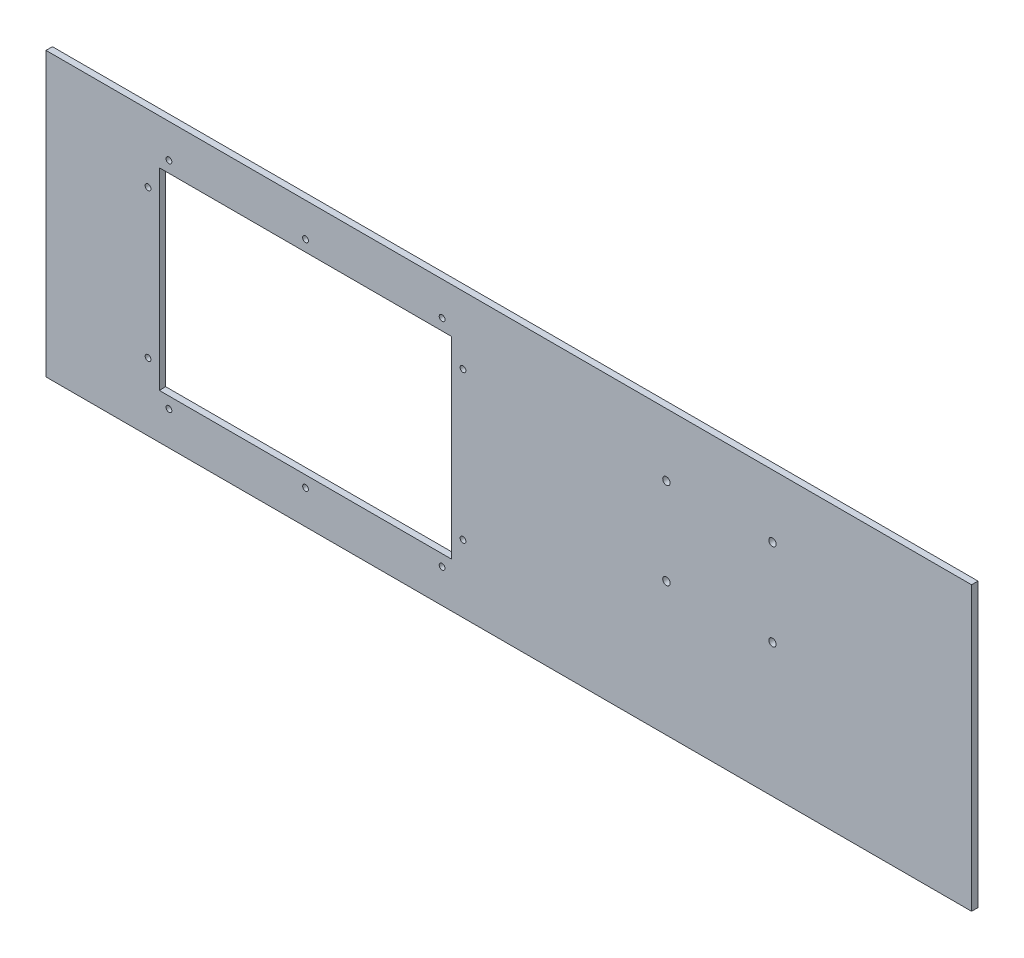
ISO-10303-21;
HEADER;
FILE_DESCRIPTION(('STEP AP214'),'2;1');
FILE_NAME('part.step','',(''),(''),'','','');
FILE_SCHEMA(('AUTOMOTIVE_DESIGN { 1 0 10303 214 1 1 1 1 }'));
ENDSEC;
DATA;
#1=APPLICATION_CONTEXT('core data for automotive mechanical design processes');
#2=APPLICATION_PROTOCOL_DEFINITION('international standard','automotive_design',2000,#1);
#3=PRODUCT_CONTEXT('',#1,'mechanical');
#4=PRODUCT('Part','Part','',(#3));
#5=PRODUCT_RELATED_PRODUCT_CATEGORY('part','',(#4));
#6=PRODUCT_DEFINITION_FORMATION('','',#4);
#7=PRODUCT_DEFINITION_CONTEXT('part definition',#1,'design');
#8=PRODUCT_DEFINITION('design','',#6,#7);
#9=PRODUCT_DEFINITION_SHAPE('','',#8);
#10=(LENGTH_UNIT() NAMED_UNIT(*) SI_UNIT(.MILLI.,.METRE.));
#11=(NAMED_UNIT(*) PLANE_ANGLE_UNIT() SI_UNIT($,.RADIAN.));
#12=(NAMED_UNIT(*) SI_UNIT($,.STERADIAN.) SOLID_ANGLE_UNIT());
#13=UNCERTAINTY_MEASURE_WITH_UNIT(LENGTH_MEASURE(1.E-05),#10,'distance_accuracy_value','');
#14=(GEOMETRIC_REPRESENTATION_CONTEXT(3) GLOBAL_UNCERTAINTY_ASSIGNED_CONTEXT((#13)) GLOBAL_UNIT_ASSIGNED_CONTEXT((#10,
#11,#12)) REPRESENTATION_CONTEXT('',''));
#15=CARTESIAN_POINT('',(0.,0.,0.));
#16=DIRECTION('',(0.,0.,1.));
#17=DIRECTION('',(1.,0.,0.));
#18=AXIS2_PLACEMENT_3D('',#15,#16,#17);
#19=CARTESIAN_POINT('',(0.,0.,-10.));
#20=DIRECTION('',(0.,0.,1.));
#21=DIRECTION('',(1.,0.,0.));
#22=AXIS2_PLACEMENT_3D('',#19,#20,#21);
#23=PLANE('',#22);
#24=CARTESIAN_POINT('',(410.249999999993,-12.5000000000117,-10.));
#25=DIRECTION('',(0.,0.,1.));
#26=DIRECTION('',(1.,0.,0.));
#27=AXIS2_PLACEMENT_3D('',#24,#25,#26);
#28=CIRCLE('',#27,5.74999999999991);
#29=CARTESIAN_POINT('',(415.999999999993,-12.5000000000117,-10.));
#30=VERTEX_POINT('',#29);
#31=EDGE_CURVE('E290',#30,#30,#28,.T.);
#32=ORIENTED_EDGE('',*,*,#31,.T.);
#33=EDGE_LOOP('',(#32));
#34=FACE_BOUND('',#33,.T.);
#35=CARTESIAN_POINT('',(410.249999999994,122.499999999988,-10.));
#36=DIRECTION('',(0.,0.,1.));
#37=DIRECTION('',(1.,0.,0.));
#38=AXIS2_PLACEMENT_3D('',#35,#36,#37);
#39=CIRCLE('',#38,5.74999999999992);
#40=CARTESIAN_POINT('',(415.999999999993,122.499999999988,-10.));
#41=VERTEX_POINT('',#40);
#42=EDGE_CURVE('E280',#41,#41,#39,.T.);
#43=ORIENTED_EDGE('',*,*,#42,.T.);
#44=EDGE_LOOP('',(#43));
#45=FACE_BOUND('',#44,.T.);
#46=CARTESIAN_POINT('',(245.249999999994,122.499999999989,-10.));
#47=DIRECTION('',(0.,0.,1.));
#48=DIRECTION('',(1.,0.,0.));
#49=AXIS2_PLACEMENT_3D('',#46,#47,#48);
#50=CIRCLE('',#49,5.75000000000003);
#51=CARTESIAN_POINT('',(250.999999999994,122.499999999989,-10.));
#52=VERTEX_POINT('',#51);
#53=EDGE_CURVE('E275',#52,#52,#50,.T.);
#54=ORIENTED_EDGE('',*,*,#53,.T.);
#55=EDGE_LOOP('',(#54));
#56=FACE_BOUND('',#55,.T.);
#57=CARTESIAN_POINT('',(245.249999999993,-12.5000000000111,-10.));
#58=DIRECTION('',(0.,0.,1.));
#59=DIRECTION('',(1.,0.,0.));
#60=AXIS2_PLACEMENT_3D('',#57,#58,#59);
#61=CIRCLE('',#60,5.75000000000003);
#62=CARTESIAN_POINT('',(250.999999999993,-12.5000000000111,-10.));
#63=VERTEX_POINT('',#62);
#64=EDGE_CURVE('E295',#63,#63,#61,.T.);
#65=ORIENTED_EDGE('',*,*,#64,.T.);
#66=EDGE_LOOP('',(#65));
#67=FACE_BOUND('',#66,.T.);
#68=CARTESIAN_POINT('',(-316.250000000007,-167.500000000004,-10.));
#69=DIRECTION('',(0.,0.,-1.));
#70=DIRECTION('',(-1.,0.,0.));
#71=AXIS2_PLACEMENT_3D('',#68,#69,#70);
#72=CIRCLE('',#71,4.50000000000002);
#73=CARTESIAN_POINT('',(-320.750000000007,-167.500000000004,-10.));
#74=VERTEX_POINT('',#73);
#75=EDGE_CURVE('E334',#74,#74,#72,.T.);
#76=ORIENTED_EDGE('',*,*,#75,.F.);
#77=EDGE_LOOP('',(#76));
#78=FACE_BOUND('',#77,.T.);
#79=CARTESIAN_POINT('',(-528.750000000007,-167.500000000003,-10.));
#80=DIRECTION('',(0.,0.,-1.));
#81=DIRECTION('',(-1.,0.,0.));
#82=AXIS2_PLACEMENT_3D('',#79,#80,#81);
#83=CIRCLE('',#82,4.4999999999999);
#84=CARTESIAN_POINT('',(-533.250000000007,-167.500000000003,-10.));
#85=VERTEX_POINT('',#84);
#86=EDGE_CURVE('E340',#85,#85,#83,.T.);
#87=ORIENTED_EDGE('',*,*,#86,.F.);
#88=EDGE_LOOP('',(#87));
#89=FACE_BOUND('',#88,.T.);
#90=CARTESIAN_POINT('',(-561.250000000007,-115.000000000003,-10.));
#91=DIRECTION('',(0.,0.,-1.));
#92=DIRECTION('',(-1.,0.,0.));
#93=AXIS2_PLACEMENT_3D('',#90,#91,#92);
#94=CIRCLE('',#93,4.49999999999991);
#95=CARTESIAN_POINT('',(-565.750000000007,-115.000000000003,-10.));
#96=VERTEX_POINT('',#95);
#97=EDGE_CURVE('E346',#96,#96,#94,.T.);
#98=ORIENTED_EDGE('',*,*,#97,.F.);
#99=EDGE_LOOP('',(#98));
#100=FACE_BOUND('',#99,.T.);
#101=CARTESIAN_POINT('',(-561.250000000006,114.999999999992,-10.));
#102=DIRECTION('',(0.,0.,-1.));
#103=DIRECTION('',(-1.,0.,0.));
#104=AXIS2_PLACEMENT_3D('',#101,#102,#103);
#105=CIRCLE('',#104,4.49999999999991);
#106=CARTESIAN_POINT('',(-565.750000000006,114.999999999992,-10.));
#107=VERTEX_POINT('',#106);
#108=EDGE_CURVE('E310',#107,#107,#105,.T.);
#109=ORIENTED_EDGE('',*,*,#108,.F.);
#110=EDGE_LOOP('',(#109));
#111=FACE_BOUND('',#110,.T.);
#112=CARTESIAN_POINT('',(-528.750000000007,167.499999999997,-10.));
#113=DIRECTION('',(0.,0.,-1.));
#114=DIRECTION('',(-1.,0.,0.));
#115=AXIS2_PLACEMENT_3D('',#112,#113,#114);
#116=CIRCLE('',#115,4.4999999999999);
#117=CARTESIAN_POINT('',(-533.250000000007,167.499999999997,-10.));
#118=VERTEX_POINT('',#117);
#119=EDGE_CURVE('E311',#118,#118,#116,.T.);
#120=ORIENTED_EDGE('',*,*,#119,.F.);
#121=EDGE_LOOP('',(#120));
#122=FACE_BOUND('',#121,.T.);
#123=CARTESIAN_POINT('',(-316.250000000008,167.499999999995,-10.));
#124=DIRECTION('',(0.,0.,-1.));
#125=DIRECTION('',(-1.,0.,0.));
#126=AXIS2_PLACEMENT_3D('',#123,#124,#125);
#127=CIRCLE('',#126,4.50000000000002);
#128=CARTESIAN_POINT('',(-320.750000000008,167.499999999995,-10.));
#129=VERTEX_POINT('',#128);
#130=EDGE_CURVE('E317',#129,#129,#127,.T.);
#131=ORIENTED_EDGE('',*,*,#130,.F.);
#132=EDGE_LOOP('',(#131));
#133=FACE_BOUND('',#132,.T.);
#134=CARTESIAN_POINT('',(-103.750000000007,167.499999999995,-10.));
#135=DIRECTION('',(0.,0.,-1.));
#136=DIRECTION('',(-1.,0.,0.));
#137=AXIS2_PLACEMENT_3D('',#134,#135,#136);
#138=CIRCLE('',#137,4.50000000000001);
#139=CARTESIAN_POINT('',(-108.250000000007,167.499999999995,-10.));
#140=VERTEX_POINT('',#139);
#141=EDGE_CURVE('E323',#140,#140,#138,.T.);
#142=ORIENTED_EDGE('',*,*,#141,.F.);
#143=EDGE_LOOP('',(#142));
#144=FACE_BOUND('',#143,.T.);
#145=CARTESIAN_POINT('',(-71.2500000000074,114.999999999992,-10.));
#146=DIRECTION('',(0.,0.,-1.));
#147=DIRECTION('',(-1.,0.,0.));
#148=AXIS2_PLACEMENT_3D('',#145,#146,#147);
#149=CIRCLE('',#148,4.50000000000001);
#150=CARTESIAN_POINT('',(-75.7500000000074,114.999999999992,-10.));
#151=VERTEX_POINT('',#150);
#152=EDGE_CURVE('E304',#151,#151,#149,.T.);
#153=ORIENTED_EDGE('',*,*,#152,.F.);
#154=EDGE_LOOP('',(#153));
#155=FACE_BOUND('',#154,.T.);
#156=CARTESIAN_POINT('',(-71.2500000000075,-115.000000000008,-10.));
#157=DIRECTION('',(0.,0.,-1.));
#158=DIRECTION('',(-1.,0.,0.));
#159=AXIS2_PLACEMENT_3D('',#156,#157,#158);
#160=CIRCLE('',#159,4.50000000000001);
#161=CARTESIAN_POINT('',(-75.7500000000075,-115.000000000008,-10.));
#162=VERTEX_POINT('',#161);
#163=EDGE_CURVE('E126',#162,#162,#160,.T.);
#164=ORIENTED_EDGE('',*,*,#163,.F.);
#165=EDGE_LOOP('',(#164));
#166=FACE_BOUND('',#165,.T.);
#167=DIRECTION('',(1.,0.,0.));
#168=VECTOR('',#167,1.);
#169=CARTESIAN_POINT('',(-543.750000000005,149.999999999992,-10.));
#170=LINE('',#169,#168);
#171=CARTESIAN_POINT('',(-543.750000000005,149.999999999992,-10.));
#172=VERTEX_POINT('',#171);
#173=CARTESIAN_POINT('',(-88.7500000000063,149.999999999992,-10.));
#174=VERTEX_POINT('',#173);
#175=EDGE_CURVE('E132',#172,#174,#170,.T.);
#176=ORIENTED_EDGE('',*,*,#175,.F.);
#177=DIRECTION('',(0.,1.,0.));
#178=VECTOR('',#177,1.);
#179=CARTESIAN_POINT('',(-543.750000000005,149.999999999992,-10.));
#180=LINE('',#179,#178);
#181=CARTESIAN_POINT('',(-543.750000000005,-150.000000000005,-10.));
#182=VERTEX_POINT('',#181);
#183=EDGE_CURVE('E53',#182,#172,#180,.T.);
#184=ORIENTED_EDGE('',*,*,#183,.F.);
#185=DIRECTION('',(-1.,0.,0.));
#186=VECTOR('',#185,1.);
#187=CARTESIAN_POINT('',(-543.750000000005,-150.000000000005,-10.));
#188=LINE('',#187,#186);
#189=CARTESIAN_POINT('',(-88.7500000000063,-150.000000000005,-10.));
#190=VERTEX_POINT('',#189);
#191=EDGE_CURVE('E120',#190,#182,#188,.T.);
#192=ORIENTED_EDGE('',*,*,#191,.F.);
#193=DIRECTION('',(0.,-1.,0.));
#194=VECTOR('',#193,1.);
#195=CARTESIAN_POINT('',(-88.7500000000063,149.999999999992,-10.));
#196=LINE('',#195,#194);
#197=EDGE_CURVE('E123',#174,#190,#196,.T.);
#198=ORIENTED_EDGE('',*,*,#197,.F.);
#199=EDGE_LOOP('',(#176,#184,#192,#198));
#200=FACE_BOUND('',#199,.T.);
#201=DIRECTION('',(0.,1.,0.));
#202=VECTOR('',#201,1.);
#203=CARTESIAN_POINT('',(720.,220.,-10.));
#204=LINE('',#203,#202);
#205=CARTESIAN_POINT('',(720.,-220.,-10.));
#206=VERTEX_POINT('',#205);
#207=CARTESIAN_POINT('',(720.,220.,-10.));
#208=VERTEX_POINT('',#207);
#209=EDGE_CURVE('E143',#206,#208,#204,.T.);
#210=ORIENTED_EDGE('',*,*,#209,.F.);
#211=DIRECTION('',(1.,0.,0.));
#212=VECTOR('',#211,1.);
#213=CARTESIAN_POINT('',(-720.,-220.,-10.));
#214=LINE('',#213,#212);
#215=CARTESIAN_POINT('',(-720.,-220.,-10.));
#216=VERTEX_POINT('',#215);
#217=EDGE_CURVE('E153',#216,#206,#214,.T.);
#218=ORIENTED_EDGE('',*,*,#217,.F.);
#219=DIRECTION('',(0.,-1.,0.));
#220=VECTOR('',#219,1.);
#221=CARTESIAN_POINT('',(-720.,220.,-10.));
#222=LINE('',#221,#220);
#223=CARTESIAN_POINT('',(-720.,220.,-10.));
#224=VERTEX_POINT('',#223);
#225=EDGE_CURVE('E150',#224,#216,#222,.T.);
#226=ORIENTED_EDGE('',*,*,#225,.F.);
#227=DIRECTION('',(-1.,0.,0.));
#228=VECTOR('',#227,1.);
#229=CARTESIAN_POINT('',(-720.,220.,-10.));
#230=LINE('',#229,#228);
#231=EDGE_CURVE('E146',#208,#224,#230,.T.);
#232=ORIENTED_EDGE('',*,*,#231,.F.);
#233=EDGE_LOOP('',(#210,#218,#226,#232));
#234=FACE_BOUND('',#233,.T.);
#235=CARTESIAN_POINT('',(-103.750000000007,-167.499999999995,-10.));
#236=DIRECTION('',(0.,0.,1.));
#237=DIRECTION('',(-1.,0.,0.));
#238=AXIS2_PLACEMENT_3D('',#235,#236,#237);
#239=CIRCLE('',#238,4.50000000000001);
#240=CARTESIAN_POINT('',(-108.250000000007,-167.499999999995,-10.));
#241=VERTEX_POINT('',#240);
#242=EDGE_CURVE('E298',#241,#241,#239,.T.);
#243=ORIENTED_EDGE('',*,*,#242,.T.);
#244=EDGE_LOOP('',(#243));
#245=FACE_BOUND('',#244,.T.);
#246=ADVANCED_FACE('F36',(#34,#45,#56,#67,#78,#89,#100,#111,#122,#133,#144,#155,#166,#200,#234,
#245),#23,.F.);
#247=CARTESIAN_POINT('',(0.,0.,0.));
#248=DIRECTION('',(0.,0.,1.));
#249=DIRECTION('',(1.,0.,0.));
#250=AXIS2_PLACEMENT_3D('',#247,#248,#249);
#251=PLANE('',#250);
#252=CARTESIAN_POINT('',(410.249999999993,-12.5000000000117,0.));
#253=DIRECTION('',(0.,0.,1.));
#254=DIRECTION('',(1.,0.,0.));
#255=AXIS2_PLACEMENT_3D('',#252,#253,#254);
#256=CIRCLE('',#255,5.74999999999991);
#257=CARTESIAN_POINT('',(415.999999999993,-12.5000000000117,0.));
#258=VERTEX_POINT('',#257);
#259=EDGE_CURVE('E292',#258,#258,#256,.T.);
#260=ORIENTED_EDGE('',*,*,#259,.F.);
#261=EDGE_LOOP('',(#260));
#262=FACE_BOUND('',#261,.T.);
#263=CARTESIAN_POINT('',(410.249999999994,122.499999999988,0.));
#264=DIRECTION('',(0.,0.,1.));
#265=DIRECTION('',(1.,0.,0.));
#266=AXIS2_PLACEMENT_3D('',#263,#264,#265);
#267=CIRCLE('',#266,5.74999999999992);
#268=CARTESIAN_POINT('',(415.999999999993,122.499999999988,0.));
#269=VERTEX_POINT('',#268);
#270=EDGE_CURVE('E285',#269,#269,#267,.T.);
#271=ORIENTED_EDGE('',*,*,#270,.F.);
#272=EDGE_LOOP('',(#271));
#273=FACE_BOUND('',#272,.T.);
#274=CARTESIAN_POINT('',(245.249999999994,122.499999999989,0.));
#275=DIRECTION('',(0.,0.,1.));
#276=DIRECTION('',(1.,0.,0.));
#277=AXIS2_PLACEMENT_3D('',#274,#275,#276);
#278=CIRCLE('',#277,5.75000000000003);
#279=CARTESIAN_POINT('',(250.999999999994,122.499999999989,0.));
#280=VERTEX_POINT('',#279);
#281=EDGE_CURVE('E278',#280,#280,#278,.T.);
#282=ORIENTED_EDGE('',*,*,#281,.F.);
#283=EDGE_LOOP('',(#282));
#284=FACE_BOUND('',#283,.T.);
#285=CARTESIAN_POINT('',(245.249999999993,-12.5000000000111,0.));
#286=DIRECTION('',(0.,0.,1.));
#287=DIRECTION('',(1.,0.,0.));
#288=AXIS2_PLACEMENT_3D('',#285,#286,#287);
#289=CIRCLE('',#288,5.75000000000003);
#290=CARTESIAN_POINT('',(250.999999999993,-12.5000000000111,0.));
#291=VERTEX_POINT('',#290);
#292=EDGE_CURVE('E282',#291,#291,#289,.T.);
#293=ORIENTED_EDGE('',*,*,#292,.F.);
#294=EDGE_LOOP('',(#293));
#295=FACE_BOUND('',#294,.T.);
#296=DIRECTION('',(0.,1.,0.));
#297=VECTOR('',#296,1.);
#298=CARTESIAN_POINT('',(720.,220.,0.));
#299=LINE('',#298,#297);
#300=CARTESIAN_POINT('',(720.,-220.,0.));
#301=VERTEX_POINT('',#300);
#302=CARTESIAN_POINT('',(720.,220.,0.));
#303=VERTEX_POINT('',#302);
#304=EDGE_CURVE('E139',#301,#303,#299,.T.);
#305=ORIENTED_EDGE('',*,*,#304,.T.);
#306=DIRECTION('',(-1.,0.,0.));
#307=VECTOR('',#306,1.);
#308=CARTESIAN_POINT('',(-720.,220.,0.));
#309=LINE('',#308,#307);
#310=CARTESIAN_POINT('',(-720.,220.,0.));
#311=VERTEX_POINT('',#310);
#312=EDGE_CURVE('E158',#303,#311,#309,.T.);
#313=ORIENTED_EDGE('',*,*,#312,.T.);
#314=DIRECTION('',(0.,-1.,0.));
#315=VECTOR('',#314,1.);
#316=CARTESIAN_POINT('',(-720.,220.,0.));
#317=LINE('',#316,#315);
#318=CARTESIAN_POINT('',(-720.,-220.,0.));
#319=VERTEX_POINT('',#318);
#320=EDGE_CURVE('E161',#311,#319,#317,.T.);
#321=ORIENTED_EDGE('',*,*,#320,.T.);
#322=DIRECTION('',(1.,0.,0.));
#323=VECTOR('',#322,1.);
#324=CARTESIAN_POINT('',(-720.,-220.,0.));
#325=LINE('',#324,#323);
#326=EDGE_CURVE('E147',#319,#301,#325,.T.);
#327=ORIENTED_EDGE('',*,*,#326,.T.);
#328=EDGE_LOOP('',(#305,#313,#321,#327));
#329=FACE_BOUND('',#328,.T.);
#330=DIRECTION('',(0.,1.,0.));
#331=VECTOR('',#330,1.);
#332=CARTESIAN_POINT('',(-543.750000000005,149.999999999992,0.));
#333=LINE('',#332,#331);
#334=CARTESIAN_POINT('',(-543.750000000005,-150.000000000005,0.));
#335=VERTEX_POINT('',#334);
#336=CARTESIAN_POINT('',(-543.750000000005,149.999999999992,0.));
#337=VERTEX_POINT('',#336);
#338=EDGE_CURVE('E104',#335,#337,#333,.T.);
#339=ORIENTED_EDGE('',*,*,#338,.T.);
#340=DIRECTION('',(1.,0.,0.));
#341=VECTOR('',#340,1.);
#342=CARTESIAN_POINT('',(-543.750000000005,149.999999999992,0.));
#343=LINE('',#342,#341);
#344=CARTESIAN_POINT('',(-88.7500000000063,149.999999999992,0.));
#345=VERTEX_POINT('',#344);
#346=EDGE_CURVE('E113',#337,#345,#343,.T.);
#347=ORIENTED_EDGE('',*,*,#346,.T.);
#348=DIRECTION('',(0.,-1.,0.));
#349=VECTOR('',#348,1.);
#350=CARTESIAN_POINT('',(-88.7500000000063,149.999999999992,0.));
#351=LINE('',#350,#349);
#352=CARTESIAN_POINT('',(-88.7500000000063,-150.000000000005,0.));
#353=VERTEX_POINT('',#352);
#354=EDGE_CURVE('E61',#345,#353,#351,.T.);
#355=ORIENTED_EDGE('',*,*,#354,.T.);
#356=DIRECTION('',(-1.,0.,0.));
#357=VECTOR('',#356,1.);
#358=CARTESIAN_POINT('',(-543.750000000005,-150.000000000005,0.));
#359=LINE('',#358,#357);
#360=EDGE_CURVE('E110',#353,#335,#359,.T.);
#361=ORIENTED_EDGE('',*,*,#360,.T.);
#362=EDGE_LOOP('',(#339,#347,#355,#361));
#363=FACE_BOUND('',#362,.T.);
#364=CARTESIAN_POINT('',(-71.2500000000075,-115.000000000008,0.));
#365=DIRECTION('',(0.,0.,-1.));
#366=DIRECTION('',(-1.,0.,0.));
#367=AXIS2_PLACEMENT_3D('',#364,#365,#366);
#368=CIRCLE('',#367,4.50000000000001);
#369=CARTESIAN_POINT('',(-75.7500000000075,-115.000000000008,0.));
#370=VERTEX_POINT('',#369);
#371=EDGE_CURVE('E133',#370,#370,#368,.T.);
#372=ORIENTED_EDGE('',*,*,#371,.T.);
#373=EDGE_LOOP('',(#372));
#374=FACE_BOUND('',#373,.T.);
#375=CARTESIAN_POINT('',(-71.2500000000074,114.999999999992,0.));
#376=DIRECTION('',(0.,0.,-1.));
#377=DIRECTION('',(-1.,0.,0.));
#378=AXIS2_PLACEMENT_3D('',#375,#376,#377);
#379=CIRCLE('',#378,4.50000000000001);
#380=CARTESIAN_POINT('',(-75.7500000000074,114.999999999992,0.));
#381=VERTEX_POINT('',#380);
#382=EDGE_CURVE('E326',#381,#381,#379,.T.);
#383=ORIENTED_EDGE('',*,*,#382,.T.);
#384=EDGE_LOOP('',(#383));
#385=FACE_BOUND('',#384,.T.);
#386=CARTESIAN_POINT('',(-103.750000000007,167.499999999995,0.));
#387=DIRECTION('',(0.,0.,-1.));
#388=DIRECTION('',(-1.,0.,0.));
#389=AXIS2_PLACEMENT_3D('',#386,#387,#388);
#390=CIRCLE('',#389,4.50000000000001);
#391=CARTESIAN_POINT('',(-108.250000000007,167.499999999995,0.));
#392=VERTEX_POINT('',#391);
#393=EDGE_CURVE('E320',#392,#392,#390,.T.);
#394=ORIENTED_EDGE('',*,*,#393,.T.);
#395=EDGE_LOOP('',(#394));
#396=FACE_BOUND('',#395,.T.);
#397=CARTESIAN_POINT('',(-316.250000000008,167.499999999995,0.));
#398=DIRECTION('',(0.,0.,-1.));
#399=DIRECTION('',(-1.,0.,0.));
#400=AXIS2_PLACEMENT_3D('',#397,#398,#399);
#401=CIRCLE('',#400,4.50000000000002);
#402=CARTESIAN_POINT('',(-320.750000000008,167.499999999995,0.));
#403=VERTEX_POINT('',#402);
#404=EDGE_CURVE('E314',#403,#403,#401,.T.);
#405=ORIENTED_EDGE('',*,*,#404,.T.);
#406=EDGE_LOOP('',(#405));
#407=FACE_BOUND('',#406,.T.);
#408=CARTESIAN_POINT('',(-528.750000000007,167.499999999997,0.));
#409=DIRECTION('',(0.,0.,-1.));
#410=DIRECTION('',(-1.,0.,0.));
#411=AXIS2_PLACEMENT_3D('',#408,#409,#410);
#412=CIRCLE('',#411,4.4999999999999);
#413=CARTESIAN_POINT('',(-533.250000000007,167.499999999997,0.));
#414=VERTEX_POINT('',#413);
#415=EDGE_CURVE('E307',#414,#414,#412,.T.);
#416=ORIENTED_EDGE('',*,*,#415,.T.);
#417=EDGE_LOOP('',(#416));
#418=FACE_BOUND('',#417,.T.);
#419=CARTESIAN_POINT('',(-561.250000000006,114.999999999992,0.));
#420=DIRECTION('',(0.,0.,-1.));
#421=DIRECTION('',(-1.,0.,0.));
#422=AXIS2_PLACEMENT_3D('',#419,#420,#421);
#423=CIRCLE('',#422,4.49999999999991);
#424=CARTESIAN_POINT('',(-565.750000000006,114.999999999992,0.));
#425=VERTEX_POINT('',#424);
#426=EDGE_CURVE('E349',#425,#425,#423,.T.);
#427=ORIENTED_EDGE('',*,*,#426,.T.);
#428=EDGE_LOOP('',(#427));
#429=FACE_BOUND('',#428,.T.);
#430=CARTESIAN_POINT('',(-561.250000000007,-115.000000000003,0.));
#431=DIRECTION('',(0.,0.,-1.));
#432=DIRECTION('',(-1.,0.,0.));
#433=AXIS2_PLACEMENT_3D('',#430,#431,#432);
#434=CIRCLE('',#433,4.49999999999991);
#435=CARTESIAN_POINT('',(-565.750000000007,-115.000000000003,0.));
#436=VERTEX_POINT('',#435);
#437=EDGE_CURVE('E343',#436,#436,#434,.T.);
#438=ORIENTED_EDGE('',*,*,#437,.T.);
#439=EDGE_LOOP('',(#438));
#440=FACE_BOUND('',#439,.T.);
#441=CARTESIAN_POINT('',(-528.750000000007,-167.500000000003,0.));
#442=DIRECTION('',(0.,0.,-1.));
#443=DIRECTION('',(-1.,0.,0.));
#444=AXIS2_PLACEMENT_3D('',#441,#442,#443);
#445=CIRCLE('',#444,4.4999999999999);
#446=CARTESIAN_POINT('',(-533.250000000007,-167.500000000003,0.));
#447=VERTEX_POINT('',#446);
#448=EDGE_CURVE('E337',#447,#447,#445,.T.);
#449=ORIENTED_EDGE('',*,*,#448,.T.);
#450=EDGE_LOOP('',(#449));
#451=FACE_BOUND('',#450,.T.);
#452=CARTESIAN_POINT('',(-316.250000000007,-167.500000000004,0.));
#453=DIRECTION('',(0.,0.,-1.));
#454=DIRECTION('',(-1.,0.,0.));
#455=AXIS2_PLACEMENT_3D('',#452,#453,#454);
#456=CIRCLE('',#455,4.50000000000002);
#457=CARTESIAN_POINT('',(-320.750000000007,-167.500000000004,0.));
#458=VERTEX_POINT('',#457);
#459=EDGE_CURVE('E331',#458,#458,#456,.T.);
#460=ORIENTED_EDGE('',*,*,#459,.T.);
#461=EDGE_LOOP('',(#460));
#462=FACE_BOUND('',#461,.T.);
#463=CARTESIAN_POINT('',(-103.750000000007,-167.499999999995,0.));
#464=DIRECTION('',(0.,0.,1.));
#465=DIRECTION('',(-1.,0.,0.));
#466=AXIS2_PLACEMENT_3D('',#463,#464,#465);
#467=CIRCLE('',#466,4.50000000000001);
#468=CARTESIAN_POINT('',(-108.250000000007,-167.499999999995,0.));
#469=VERTEX_POINT('',#468);
#470=EDGE_CURVE('E301',#469,#469,#467,.T.);
#471=ORIENTED_EDGE('',*,*,#470,.F.);
#472=EDGE_LOOP('',(#471));
#473=FACE_BOUND('',#472,.T.);
#474=ADVANCED_FACE('F117',(#262,#273,#284,#295,#329,#363,#374,#385,#396,#407,#418,#429,#440,
#451,#462,#473),#251,.T.);
#475=CARTESIAN_POINT('',(720.,220.,-10.));
#476=DIRECTION('',(1.,0.,0.));
#477=DIRECTION('',(0.,0.,-1.));
#478=AXIS2_PLACEMENT_3D('',#475,#476,#477);
#479=PLANE('',#478);
#480=ORIENTED_EDGE('',*,*,#304,.F.);
#481=DIRECTION('',(0.,0.,1.));
#482=VECTOR('',#481,1.);
#483=CARTESIAN_POINT('',(720.,-220.,-10.));
#484=LINE('',#483,#482);
#485=EDGE_CURVE('E11',#206,#301,#484,.T.);
#486=ORIENTED_EDGE('',*,*,#485,.F.);
#487=ORIENTED_EDGE('',*,*,#209,.T.);
#488=DIRECTION('',(0.,0.,1.));
#489=VECTOR('',#488,1.);
#490=CARTESIAN_POINT('',(720.,220.,-10.));
#491=LINE('',#490,#489);
#492=EDGE_CURVE('E40',#208,#303,#491,.T.);
#493=ORIENTED_EDGE('',*,*,#492,.T.);
#494=EDGE_LOOP('',(#480,#486,#487,#493));
#495=FACE_BOUND('',#494,.T.);
#496=ADVANCED_FACE('F38',(#495),#479,.T.);
#497=CARTESIAN_POINT('',(-720.,-220.,-10.));
#498=DIRECTION('',(0.,-1.,0.));
#499=DIRECTION('',(0.,0.,-1.));
#500=AXIS2_PLACEMENT_3D('',#497,#498,#499);
#501=PLANE('',#500);
#502=ORIENTED_EDGE('',*,*,#326,.F.);
#503=DIRECTION('',(0.,0.,1.));
#504=VECTOR('',#503,1.);
#505=CARTESIAN_POINT('',(-720.,-220.,-10.));
#506=LINE('',#505,#504);
#507=EDGE_CURVE('E45',#216,#319,#506,.T.);
#508=ORIENTED_EDGE('',*,*,#507,.F.);
#509=ORIENTED_EDGE('',*,*,#217,.T.);
#510=ORIENTED_EDGE('',*,*,#485,.T.);
#511=EDGE_LOOP('',(#502,#508,#509,#510));
#512=FACE_BOUND('',#511,.T.);
#513=ADVANCED_FACE('F178',(#512),#501,.T.);
#514=CARTESIAN_POINT('',(-720.,220.,-10.));
#515=DIRECTION('',(-1.,0.,0.));
#516=DIRECTION('',(0.,-1.,0.));
#517=AXIS2_PLACEMENT_3D('',#514,#515,#516);
#518=PLANE('',#517);
#519=ORIENTED_EDGE('',*,*,#320,.F.);
#520=DIRECTION('',(0.,0.,1.));
#521=VECTOR('',#520,1.);
#522=CARTESIAN_POINT('',(-720.,220.,-10.));
#523=LINE('',#522,#521);
#524=EDGE_CURVE('E166',#224,#311,#523,.T.);
#525=ORIENTED_EDGE('',*,*,#524,.F.);
#526=ORIENTED_EDGE('',*,*,#225,.T.);
#527=ORIENTED_EDGE('',*,*,#507,.T.);
#528=EDGE_LOOP('',(#519,#525,#526,#527));
#529=FACE_BOUND('',#528,.T.);
#530=ADVANCED_FACE('F184',(#529),#518,.T.);
#531=CARTESIAN_POINT('',(-720.,220.,-10.));
#532=DIRECTION('',(0.,1.,0.));
#533=DIRECTION('',(0.,0.,1.));
#534=AXIS2_PLACEMENT_3D('',#531,#532,#533);
#535=PLANE('',#534);
#536=ORIENTED_EDGE('',*,*,#312,.F.);
#537=ORIENTED_EDGE('',*,*,#492,.F.);
#538=ORIENTED_EDGE('',*,*,#231,.T.);
#539=ORIENTED_EDGE('',*,*,#524,.T.);
#540=EDGE_LOOP('',(#536,#537,#538,#539));
#541=FACE_BOUND('',#540,.T.);
#542=ADVANCED_FACE('F174',(#541),#535,.T.);
#543=CARTESIAN_POINT('',(-543.750000000005,149.999999999992,0.));
#544=DIRECTION('',(-1.,0.,0.));
#545=DIRECTION('',(0.,0.,1.));
#546=AXIS2_PLACEMENT_3D('',#543,#544,#545);
#547=PLANE('',#546);
#548=ORIENTED_EDGE('',*,*,#183,.T.);
#549=DIRECTION('',(0.,0.,-1.));
#550=VECTOR('',#549,1.);
#551=CARTESIAN_POINT('',(-543.750000000005,149.999999999992,0.));
#552=LINE('',#551,#550);
#553=EDGE_CURVE('E100',#337,#172,#552,.T.);
#554=ORIENTED_EDGE('',*,*,#553,.F.);
#555=ORIENTED_EDGE('',*,*,#338,.F.);
#556=DIRECTION('',(0.,0.,-1.));
#557=VECTOR('',#556,1.);
#558=CARTESIAN_POINT('',(-543.750000000005,-150.000000000005,0.));
#559=LINE('',#558,#557);
#560=EDGE_CURVE('E137',#335,#182,#559,.T.);
#561=ORIENTED_EDGE('',*,*,#560,.T.);
#562=EDGE_LOOP('',(#548,#554,#555,#561));
#563=FACE_BOUND('',#562,.T.);
#564=ADVANCED_FACE('F102',(#563),#547,.F.);
#565=CARTESIAN_POINT('',(-543.750000000005,-150.000000000005,0.));
#566=DIRECTION('',(0.,-1.,0.));
#567=DIRECTION('',(0.,0.,-1.));
#568=AXIS2_PLACEMENT_3D('',#565,#566,#567);
#569=PLANE('',#568);
#570=ORIENTED_EDGE('',*,*,#191,.T.);
#571=ORIENTED_EDGE('',*,*,#560,.F.);
#572=ORIENTED_EDGE('',*,*,#360,.F.);
#573=DIRECTION('',(0.,0.,-1.));
#574=VECTOR('',#573,1.);
#575=CARTESIAN_POINT('',(-88.7500000000063,-150.000000000005,0.));
#576=LINE('',#575,#574);
#577=EDGE_CURVE('E140',#353,#190,#576,.T.);
#578=ORIENTED_EDGE('',*,*,#577,.T.);
#579=EDGE_LOOP('',(#570,#571,#572,#578));
#580=FACE_BOUND('',#579,.T.);
#581=ADVANCED_FACE('F206',(#580),#569,.F.);
#582=CARTESIAN_POINT('',(-88.7500000000063,149.999999999992,0.));
#583=DIRECTION('',(1.,0.,0.));
#584=DIRECTION('',(0.,0.,-1.));
#585=AXIS2_PLACEMENT_3D('',#582,#583,#584);
#586=PLANE('',#585);
#587=ORIENTED_EDGE('',*,*,#197,.T.);
#588=ORIENTED_EDGE('',*,*,#577,.F.);
#589=ORIENTED_EDGE('',*,*,#354,.F.);
#590=DIRECTION('',(0.,0.,-1.));
#591=VECTOR('',#590,1.);
#592=CARTESIAN_POINT('',(-88.7500000000063,149.999999999992,0.));
#593=LINE('',#592,#591);
#594=EDGE_CURVE('E109',#345,#174,#593,.T.);
#595=ORIENTED_EDGE('',*,*,#594,.T.);
#596=EDGE_LOOP('',(#587,#588,#589,#595));
#597=FACE_BOUND('',#596,.T.);
#598=ADVANCED_FACE('F210',(#597),#586,.F.);
#599=CARTESIAN_POINT('',(-543.750000000005,149.999999999992,0.));
#600=DIRECTION('',(0.,1.,0.));
#601=DIRECTION('',(0.,0.,1.));
#602=AXIS2_PLACEMENT_3D('',#599,#600,#601);
#603=PLANE('',#602);
#604=ORIENTED_EDGE('',*,*,#175,.T.);
#605=ORIENTED_EDGE('',*,*,#594,.F.);
#606=ORIENTED_EDGE('',*,*,#346,.F.);
#607=ORIENTED_EDGE('',*,*,#553,.T.);
#608=EDGE_LOOP('',(#604,#605,#606,#607));
#609=FACE_BOUND('',#608,.T.);
#610=ADVANCED_FACE('F114',(#609),#603,.F.);
#611=CARTESIAN_POINT('',(-71.2500000000075,-115.000000000008,0.));
#612=DIRECTION('',(0.,0.,-1.));
#613=DIRECTION('',(-1.,0.,0.));
#614=AXIS2_PLACEMENT_3D('',#611,#612,#613);
#615=CYLINDRICAL_SURFACE('',#614,4.50000000000001);
#616=ORIENTED_EDGE('',*,*,#371,.F.);
#617=EDGE_LOOP('',(#616));
#618=FACE_BOUND('',#617,.T.);
#619=ORIENTED_EDGE('',*,*,#163,.T.);
#620=EDGE_LOOP('',(#619));
#621=FACE_BOUND('',#620,.T.);
#622=ADVANCED_FACE('F209',(#618,#621),#615,.F.);
#623=CARTESIAN_POINT('',(-71.2500000000074,114.999999999992,0.));
#624=DIRECTION('',(0.,0.,-1.));
#625=DIRECTION('',(-1.,0.,0.));
#626=AXIS2_PLACEMENT_3D('',#623,#624,#625);
#627=CYLINDRICAL_SURFACE('',#626,4.50000000000001);
#628=ORIENTED_EDGE('',*,*,#382,.F.);
#629=EDGE_LOOP('',(#628));
#630=FACE_BOUND('',#629,.T.);
#631=ORIENTED_EDGE('',*,*,#152,.T.);
#632=EDGE_LOOP('',(#631));
#633=FACE_BOUND('',#632,.T.);
#634=ADVANCED_FACE('F218',(#630,#633),#627,.F.);
#635=CARTESIAN_POINT('',(-103.750000000007,167.499999999995,0.));
#636=DIRECTION('',(0.,0.,-1.));
#637=DIRECTION('',(-1.,0.,0.));
#638=AXIS2_PLACEMENT_3D('',#635,#636,#637);
#639=CYLINDRICAL_SURFACE('',#638,4.50000000000001);
#640=ORIENTED_EDGE('',*,*,#393,.F.);
#641=EDGE_LOOP('',(#640));
#642=FACE_BOUND('',#641,.T.);
#643=ORIENTED_EDGE('',*,*,#141,.T.);
#644=EDGE_LOOP('',(#643));
#645=FACE_BOUND('',#644,.T.);
#646=ADVANCED_FACE('F240',(#642,#645),#639,.F.);
#647=CARTESIAN_POINT('',(-316.250000000008,167.499999999995,0.));
#648=DIRECTION('',(0.,0.,-1.));
#649=DIRECTION('',(-1.,0.,0.));
#650=AXIS2_PLACEMENT_3D('',#647,#648,#649);
#651=CYLINDRICAL_SURFACE('',#650,4.50000000000002);
#652=ORIENTED_EDGE('',*,*,#404,.F.);
#653=EDGE_LOOP('',(#652));
#654=FACE_BOUND('',#653,.T.);
#655=ORIENTED_EDGE('',*,*,#130,.T.);
#656=EDGE_LOOP('',(#655));
#657=FACE_BOUND('',#656,.T.);
#658=ADVANCED_FACE('F244',(#654,#657),#651,.F.);
#659=CARTESIAN_POINT('',(-528.750000000007,167.499999999997,0.));
#660=DIRECTION('',(0.,0.,-1.));
#661=DIRECTION('',(-1.,0.,0.));
#662=AXIS2_PLACEMENT_3D('',#659,#660,#661);
#663=CYLINDRICAL_SURFACE('',#662,4.4999999999999);
#664=ORIENTED_EDGE('',*,*,#415,.F.);
#665=EDGE_LOOP('',(#664));
#666=FACE_BOUND('',#665,.T.);
#667=ORIENTED_EDGE('',*,*,#119,.T.);
#668=EDGE_LOOP('',(#667));
#669=FACE_BOUND('',#668,.T.);
#670=ADVANCED_FACE('F224',(#666,#669),#663,.F.);
#671=CARTESIAN_POINT('',(-561.250000000006,114.999999999992,0.));
#672=DIRECTION('',(0.,0.,-1.));
#673=DIRECTION('',(-1.,0.,0.));
#674=AXIS2_PLACEMENT_3D('',#671,#672,#673);
#675=CYLINDRICAL_SURFACE('',#674,4.49999999999991);
#676=ORIENTED_EDGE('',*,*,#426,.F.);
#677=EDGE_LOOP('',(#676));
#678=FACE_BOUND('',#677,.T.);
#679=ORIENTED_EDGE('',*,*,#108,.T.);
#680=EDGE_LOOP('',(#679));
#681=FACE_BOUND('',#680,.T.);
#682=ADVANCED_FACE('F220',(#678,#681),#675,.F.);
#683=CARTESIAN_POINT('',(-561.250000000007,-115.000000000003,0.));
#684=DIRECTION('',(0.,0.,-1.));
#685=DIRECTION('',(-1.,0.,0.));
#686=AXIS2_PLACEMENT_3D('',#683,#684,#685);
#687=CYLINDRICAL_SURFACE('',#686,4.49999999999991);
#688=ORIENTED_EDGE('',*,*,#437,.F.);
#689=EDGE_LOOP('',(#688));
#690=FACE_BOUND('',#689,.T.);
#691=ORIENTED_EDGE('',*,*,#97,.T.);
#692=EDGE_LOOP('',(#691));
#693=FACE_BOUND('',#692,.T.);
#694=ADVANCED_FACE('F223',(#690,#693),#687,.F.);
#695=CARTESIAN_POINT('',(-528.750000000007,-167.500000000003,0.));
#696=DIRECTION('',(0.,0.,-1.));
#697=DIRECTION('',(-1.,0.,0.));
#698=AXIS2_PLACEMENT_3D('',#695,#696,#697);
#699=CYLINDRICAL_SURFACE('',#698,4.4999999999999);
#700=ORIENTED_EDGE('',*,*,#448,.F.);
#701=EDGE_LOOP('',(#700));
#702=FACE_BOUND('',#701,.T.);
#703=ORIENTED_EDGE('',*,*,#86,.T.);
#704=EDGE_LOOP('',(#703));
#705=FACE_BOUND('',#704,.T.);
#706=ADVANCED_FACE('F228',(#702,#705),#699,.F.);
#707=CARTESIAN_POINT('',(-316.250000000007,-167.500000000004,0.));
#708=DIRECTION('',(0.,0.,-1.));
#709=DIRECTION('',(-1.,0.,0.));
#710=AXIS2_PLACEMENT_3D('',#707,#708,#709);
#711=CYLINDRICAL_SURFACE('',#710,4.50000000000002);
#712=ORIENTED_EDGE('',*,*,#459,.F.);
#713=EDGE_LOOP('',(#712));
#714=FACE_BOUND('',#713,.T.);
#715=ORIENTED_EDGE('',*,*,#75,.T.);
#716=EDGE_LOOP('',(#715));
#717=FACE_BOUND('',#716,.T.);
#718=ADVANCED_FACE('F232',(#714,#717),#711,.F.);
#719=CARTESIAN_POINT('',(-103.750000000007,-167.499999999995,0.));
#720=DIRECTION('',(0.,0.,-1.));
#721=DIRECTION('',(-1.,0.,0.));
#722=AXIS2_PLACEMENT_3D('',#719,#720,#721);
#723=CYLINDRICAL_SURFACE('',#722,4.50000000000001);
#724=ORIENTED_EDGE('',*,*,#470,.T.);
#725=EDGE_LOOP('',(#724));
#726=FACE_BOUND('',#725,.T.);
#727=ORIENTED_EDGE('',*,*,#242,.F.);
#728=EDGE_LOOP('',(#727));
#729=FACE_BOUND('',#728,.T.);
#730=ADVANCED_FACE('F236',(#726,#729),#723,.F.);
#731=CARTESIAN_POINT('',(245.249999999993,-12.5000000000111,-10.));
#732=DIRECTION('',(0.,0.,1.));
#733=DIRECTION('',(1.,0.,0.));
#734=AXIS2_PLACEMENT_3D('',#731,#732,#733);
#735=CYLINDRICAL_SURFACE('',#734,5.75000000000003);
#736=ORIENTED_EDGE('',*,*,#64,.F.);
#737=EDGE_LOOP('',(#736));
#738=FACE_BOUND('',#737,.T.);
#739=ORIENTED_EDGE('',*,*,#292,.T.);
#740=EDGE_LOOP('',(#739));
#741=FACE_BOUND('',#740,.T.);
#742=ADVANCED_FACE('F254',(#738,#741),#735,.F.);
#743=CARTESIAN_POINT('',(245.249999999994,122.499999999989,-10.));
#744=DIRECTION('',(0.,0.,1.));
#745=DIRECTION('',(1.,0.,0.));
#746=AXIS2_PLACEMENT_3D('',#743,#744,#745);
#747=CYLINDRICAL_SURFACE('',#746,5.75000000000003);
#748=ORIENTED_EDGE('',*,*,#53,.F.);
#749=EDGE_LOOP('',(#748));
#750=FACE_BOUND('',#749,.T.);
#751=ORIENTED_EDGE('',*,*,#281,.T.);
#752=EDGE_LOOP('',(#751));
#753=FACE_BOUND('',#752,.T.);
#754=ADVANCED_FACE('F258',(#750,#753),#747,.F.);
#755=CARTESIAN_POINT('',(410.249999999994,122.499999999988,-10.));
#756=DIRECTION('',(0.,0.,1.));
#757=DIRECTION('',(1.,0.,0.));
#758=AXIS2_PLACEMENT_3D('',#755,#756,#757);
#759=CYLINDRICAL_SURFACE('',#758,5.74999999999992);
#760=ORIENTED_EDGE('',*,*,#42,.F.);
#761=EDGE_LOOP('',(#760));
#762=FACE_BOUND('',#761,.T.);
#763=ORIENTED_EDGE('',*,*,#270,.T.);
#764=EDGE_LOOP('',(#763));
#765=FACE_BOUND('',#764,.T.);
#766=ADVANCED_FACE('F263',(#762,#765),#759,.F.);
#767=CARTESIAN_POINT('',(410.249999999993,-12.5000000000117,-10.));
#768=DIRECTION('',(0.,0.,1.));
#769=DIRECTION('',(1.,0.,0.));
#770=AXIS2_PLACEMENT_3D('',#767,#768,#769);
#771=CYLINDRICAL_SURFACE('',#770,5.74999999999991);
#772=ORIENTED_EDGE('',*,*,#31,.F.);
#773=EDGE_LOOP('',(#772));
#774=FACE_BOUND('',#773,.T.);
#775=ORIENTED_EDGE('',*,*,#259,.T.);
#776=EDGE_LOOP('',(#775));
#777=FACE_BOUND('',#776,.T.);
#778=ADVANCED_FACE('F260',(#774,#777),#771,.F.);
#779=CLOSED_SHELL('',(#246,#474,#496,#513,#530,#542,#564,#581,#598,#610,#622,#634,#646,#658,
#670,#682,#694,#706,#718,#730,#742,#754,#766,#778));
#780=MANIFOLD_SOLID_BREP('B2',#779);
#781=ADVANCED_BREP_SHAPE_REPRESENTATION('',(#18,#780),#14);
#782=SHAPE_DEFINITION_REPRESENTATION(#9,#781);
ENDSEC;
END-ISO-10303-21;
